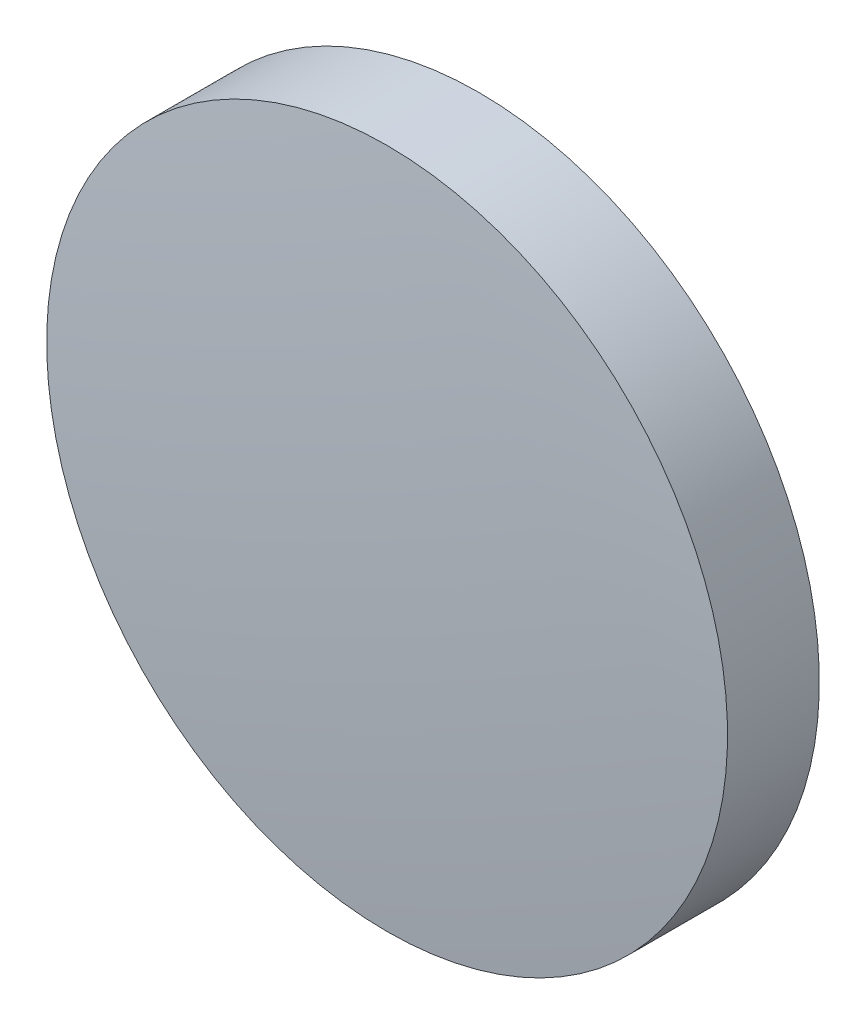
ISO-10303-21;
HEADER;
FILE_DESCRIPTION(('STEP AP214'),'2;1');
FILE_NAME('part.step','',(''),(''),'','','');
FILE_SCHEMA(('AUTOMOTIVE_DESIGN { 1 0 10303 214 1 1 1 1 }'));
ENDSEC;
DATA;
#1=APPLICATION_CONTEXT('core data for automotive mechanical design processes');
#2=APPLICATION_PROTOCOL_DEFINITION('international standard','automotive_design',2000,#1);
#3=PRODUCT_CONTEXT('',#1,'mechanical');
#4=PRODUCT('Part','Part','',(#3));
#5=PRODUCT_RELATED_PRODUCT_CATEGORY('part','',(#4));
#6=PRODUCT_DEFINITION_FORMATION('','',#4);
#7=PRODUCT_DEFINITION_CONTEXT('part definition',#1,'design');
#8=PRODUCT_DEFINITION('design','',#6,#7);
#9=PRODUCT_DEFINITION_SHAPE('','',#8);
#10=(LENGTH_UNIT() NAMED_UNIT(*) SI_UNIT(.MILLI.,.METRE.));
#11=(NAMED_UNIT(*) PLANE_ANGLE_UNIT() SI_UNIT($,.RADIAN.));
#12=(NAMED_UNIT(*) SI_UNIT($,.STERADIAN.) SOLID_ANGLE_UNIT());
#13=UNCERTAINTY_MEASURE_WITH_UNIT(LENGTH_MEASURE(1.E-05),#10,'distance_accuracy_value','');
#14=(GEOMETRIC_REPRESENTATION_CONTEXT(3) GLOBAL_UNCERTAINTY_ASSIGNED_CONTEXT((#13)) GLOBAL_UNIT_ASSIGNED_CONTEXT((#10,
#11,#12)) REPRESENTATION_CONTEXT('',''));
#15=CARTESIAN_POINT('',(0.,0.,0.));
#16=DIRECTION('',(0.,0.,1.));
#17=DIRECTION('',(1.,0.,0.));
#18=AXIS2_PLACEMENT_3D('',#15,#16,#17);
#19=CARTESIAN_POINT('',(0.,0.,-2.));
#20=DIRECTION('',(0.,0.,-1.));
#21=DIRECTION('',(0.,1.,0.));
#22=AXIS2_PLACEMENT_3D('',#19,#20,#21);
#23=PLANE('',#22);
#24=CARTESIAN_POINT('',(0.,0.,-2.));
#25=DIRECTION('',(0.,0.,-1.));
#26=DIRECTION('',(0.,1.,0.));
#27=AXIS2_PLACEMENT_3D('',#24,#25,#26);
#28=CIRCLE('',#27,12.7);
#29=CARTESIAN_POINT('',(0.,12.7,-2.));
#30=VERTEX_POINT('',#29);
#31=EDGE_CURVE('E36',#30,#30,#28,.T.);
#32=ORIENTED_EDGE('',*,*,#31,.T.);
#33=EDGE_LOOP('',(#32));
#34=FACE_BOUND('',#33,.T.);
#35=ADVANCED_FACE('F30',(#34),#23,.T.);
#36=CARTESIAN_POINT('',(0.,0.,-138.5));
#37=DIRECTION('',(0.,0.,-1.));
#38=DIRECTION('',(0.,1.,0.));
#39=AXIS2_PLACEMENT_3D('',#36,#37,#38);
#40=SPHERICAL_SURFACE('',#39,140.5);
#41=CARTESIAN_POINT('',(0.,0.,1.42483696613718));
#42=DIRECTION('',(0.,0.,-1.));
#43=DIRECTION('',(0.,1.,0.));
#44=AXIS2_PLACEMENT_3D('',#41,#42,#43);
#45=CIRCLE('',#44,12.7);
#46=CARTESIAN_POINT('',(0.,12.7,1.42483696613718));
#47=VERTEX_POINT('',#46);
#48=EDGE_CURVE('E10',#47,#47,#45,.T.);
#49=ORIENTED_EDGE('',*,*,#48,.F.);
#50=EDGE_LOOP('',(#49));
#51=FACE_BOUND('',#50,.T.);
#52=ADVANCED_FACE('F45',(#51),#40,.T.);
#53=CARTESIAN_POINT('',(0.,0.,-2.));
#54=DIRECTION('',(0.,0.,-1.));
#55=DIRECTION('',(0.,1.,0.));
#56=AXIS2_PLACEMENT_3D('',#53,#54,#55);
#57=CYLINDRICAL_SURFACE('',#56,12.7);
#58=ORIENTED_EDGE('',*,*,#48,.T.);
#59=EDGE_LOOP('',(#58));
#60=FACE_BOUND('',#59,.T.);
#61=ORIENTED_EDGE('',*,*,#31,.F.);
#62=EDGE_LOOP('',(#61));
#63=FACE_BOUND('',#62,.T.);
#64=ADVANCED_FACE('F43',(#60,#63),#57,.T.);
#65=CLOSED_SHELL('',(#35,#52,#64));
#66=MANIFOLD_SOLID_BREP('B2',#65);
#67=ADVANCED_BREP_SHAPE_REPRESENTATION('',(#18,#66),#14);
#68=SHAPE_DEFINITION_REPRESENTATION(#9,#67);
ENDSEC;
END-ISO-10303-21;
